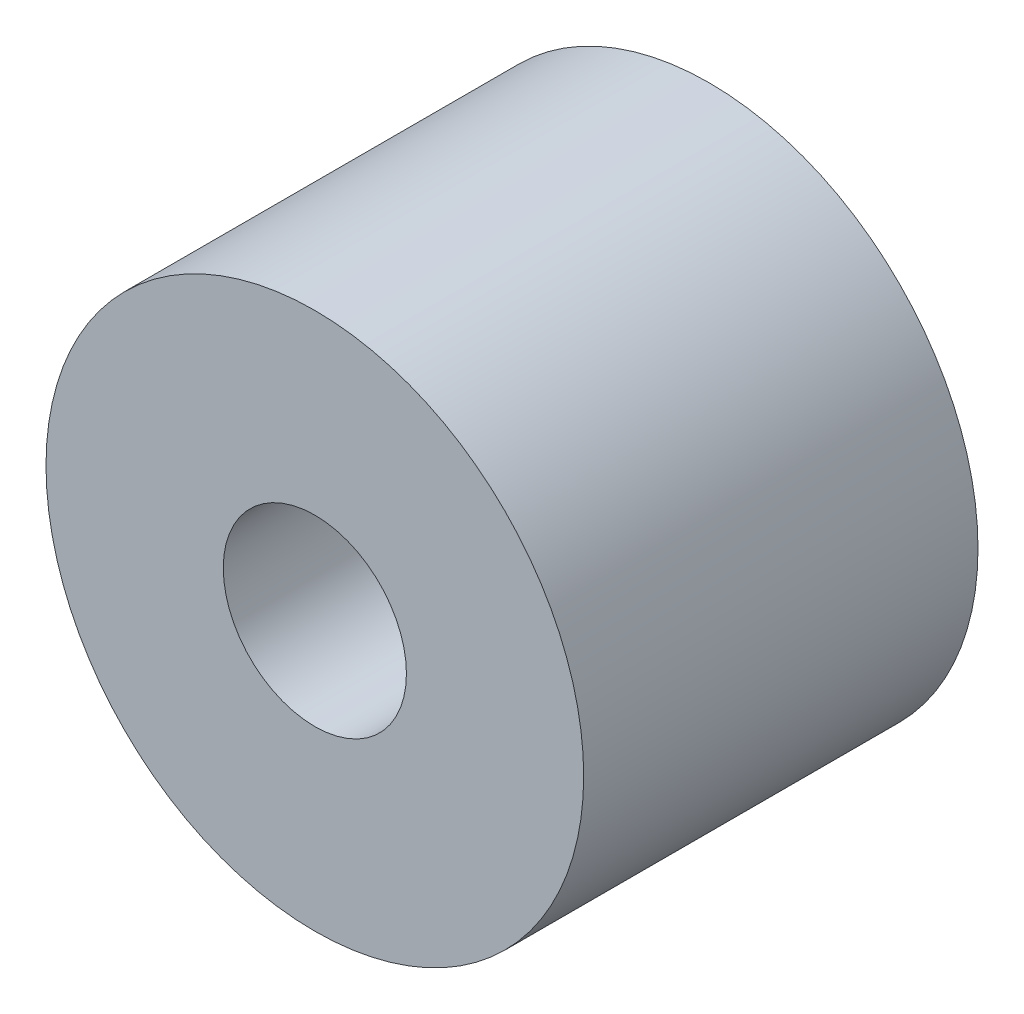
ISO-10303-21;
HEADER;
FILE_DESCRIPTION(('STEP AP214'),'2;1');
FILE_NAME('part.step','',(''),(''),'','','');
FILE_SCHEMA(('AUTOMOTIVE_DESIGN { 1 0 10303 214 1 1 1 1 }'));
ENDSEC;
DATA;
#1=APPLICATION_CONTEXT('core data for automotive mechanical design processes');
#2=APPLICATION_PROTOCOL_DEFINITION('international standard','automotive_design',2000,#1);
#3=PRODUCT_CONTEXT('',#1,'mechanical');
#4=PRODUCT('Part','Part','',(#3));
#5=PRODUCT_RELATED_PRODUCT_CATEGORY('part','',(#4));
#6=PRODUCT_DEFINITION_FORMATION('','',#4);
#7=PRODUCT_DEFINITION_CONTEXT('part definition',#1,'design');
#8=PRODUCT_DEFINITION('design','',#6,#7);
#9=PRODUCT_DEFINITION_SHAPE('','',#8);
#10=(LENGTH_UNIT() NAMED_UNIT(*) SI_UNIT(.MILLI.,.METRE.));
#11=(NAMED_UNIT(*) PLANE_ANGLE_UNIT() SI_UNIT($,.RADIAN.));
#12=(NAMED_UNIT(*) SI_UNIT($,.STERADIAN.) SOLID_ANGLE_UNIT());
#13=UNCERTAINTY_MEASURE_WITH_UNIT(LENGTH_MEASURE(1.E-05),#10,'distance_accuracy_value','');
#14=(GEOMETRIC_REPRESENTATION_CONTEXT(3) GLOBAL_UNCERTAINTY_ASSIGNED_CONTEXT((#13)) GLOBAL_UNIT_ASSIGNED_CONTEXT((#10,
#11,#12)) REPRESENTATION_CONTEXT('',''));
#15=CARTESIAN_POINT('',(0.,0.,0.));
#16=DIRECTION('',(0.,0.,1.));
#17=DIRECTION('',(1.,0.,0.));
#18=AXIS2_PLACEMENT_3D('',#15,#16,#17);
#19=CARTESIAN_POINT('',(0.,0.,11.));
#20=DIRECTION('',(0.,0.,1.));
#21=DIRECTION('',(1.,0.,0.));
#22=AXIS2_PLACEMENT_3D('',#19,#20,#21);
#23=PLANE('',#22);
#24=CARTESIAN_POINT('',(0.,0.,11.));
#25=DIRECTION('',(0.,0.,1.));
#26=DIRECTION('',(1.,0.,0.));
#27=AXIS2_PLACEMENT_3D('',#24,#25,#26);
#28=CIRCLE('',#27,7.5);
#29=CARTESIAN_POINT('',(7.5,0.,11.));
#30=VERTEX_POINT('',#29);
#31=EDGE_CURVE('E10',#30,#30,#28,.T.);
#32=ORIENTED_EDGE('',*,*,#31,.T.);
#33=EDGE_LOOP('',(#32));
#34=FACE_BOUND('',#33,.T.);
#35=CARTESIAN_POINT('',(0.,0.,11.));
#36=DIRECTION('',(0.,0.,1.));
#37=DIRECTION('',(1.,0.,0.));
#38=AXIS2_PLACEMENT_3D('',#35,#36,#37);
#39=CIRCLE('',#38,2.555);
#40=CARTESIAN_POINT('',(2.555,0.,11.));
#41=VERTEX_POINT('',#40);
#42=EDGE_CURVE('E50',#41,#41,#39,.T.);
#43=ORIENTED_EDGE('',*,*,#42,.F.);
#44=EDGE_LOOP('',(#43));
#45=FACE_BOUND('',#44,.T.);
#46=ADVANCED_FACE('F39',(#34,#45),#23,.T.);
#47=CARTESIAN_POINT('',(0.,0.,0.));
#48=DIRECTION('',(0.,0.,1.));
#49=DIRECTION('',(1.,0.,0.));
#50=AXIS2_PLACEMENT_3D('',#47,#48,#49);
#51=PLANE('',#50);
#52=CARTESIAN_POINT('',(0.,0.,0.));
#53=DIRECTION('',(0.,0.,1.));
#54=DIRECTION('',(1.,0.,0.));
#55=AXIS2_PLACEMENT_3D('',#52,#53,#54);
#56=CIRCLE('',#55,7.5);
#57=CARTESIAN_POINT('',(7.5,0.,0.));
#58=VERTEX_POINT('',#57);
#59=EDGE_CURVE('E43',#58,#58,#56,.T.);
#60=ORIENTED_EDGE('',*,*,#59,.F.);
#61=EDGE_LOOP('',(#60));
#62=FACE_BOUND('',#61,.T.);
#63=CARTESIAN_POINT('',(0.,0.,0.));
#64=DIRECTION('',(0.,0.,1.));
#65=DIRECTION('',(1.,0.,0.));
#66=AXIS2_PLACEMENT_3D('',#63,#64,#65);
#67=CIRCLE('',#66,2.555);
#68=CARTESIAN_POINT('',(2.555,0.,0.));
#69=VERTEX_POINT('',#68);
#70=EDGE_CURVE('E52',#69,#69,#67,.T.);
#71=ORIENTED_EDGE('',*,*,#70,.T.);
#72=EDGE_LOOP('',(#71));
#73=FACE_BOUND('',#72,.T.);
#74=ADVANCED_FACE('F62',(#62,#73),#51,.F.);
#75=CARTESIAN_POINT('',(0.,0.,11.));
#76=DIRECTION('',(0.,0.,-1.));
#77=DIRECTION('',(-1.,0.,0.));
#78=AXIS2_PLACEMENT_3D('',#75,#76,#77);
#79=CYLINDRICAL_SURFACE('',#78,7.5);
#80=ORIENTED_EDGE('',*,*,#31,.F.);
#81=EDGE_LOOP('',(#80));
#82=FACE_BOUND('',#81,.T.);
#83=ORIENTED_EDGE('',*,*,#59,.T.);
#84=EDGE_LOOP('',(#83));
#85=FACE_BOUND('',#84,.T.);
#86=ADVANCED_FACE('F41',(#82,#85),#79,.T.);
#87=CARTESIAN_POINT('',(0.,0.,11.));
#88=DIRECTION('',(0.,0.,-1.));
#89=DIRECTION('',(-1.,0.,0.));
#90=AXIS2_PLACEMENT_3D('',#87,#88,#89);
#91=CYLINDRICAL_SURFACE('',#90,2.555);
#92=ORIENTED_EDGE('',*,*,#42,.T.);
#93=EDGE_LOOP('',(#92));
#94=FACE_BOUND('',#93,.T.);
#95=ORIENTED_EDGE('',*,*,#70,.F.);
#96=EDGE_LOOP('',(#95));
#97=FACE_BOUND('',#96,.T.);
#98=ADVANCED_FACE('F58',(#94,#97),#91,.F.);
#99=CLOSED_SHELL('',(#46,#74,#86,#98));
#100=MANIFOLD_SOLID_BREP('B2',#99);
#101=ADVANCED_BREP_SHAPE_REPRESENTATION('',(#18,#100),#14);
#102=SHAPE_DEFINITION_REPRESENTATION(#9,#101);
ENDSEC;
END-ISO-10303-21;
